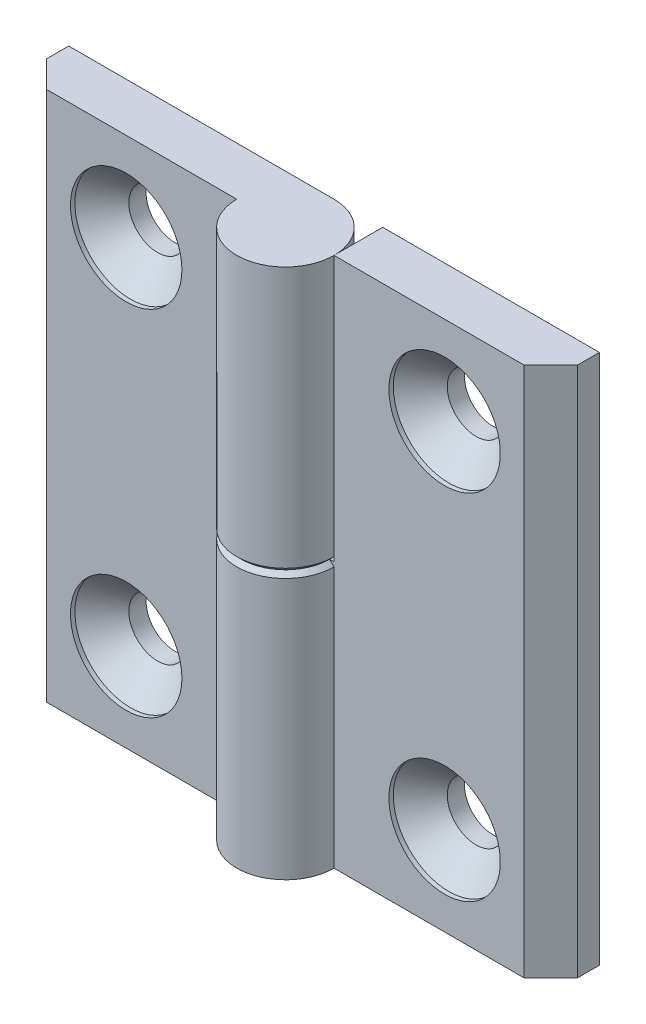
ISO-10303-21;
HEADER;
FILE_DESCRIPTION(('STEP AP214'),'2;1');
FILE_NAME('part.step','',(''),(''),'','','');
FILE_SCHEMA(('AUTOMOTIVE_DESIGN { 1 0 10303 214 1 1 1 1 }'));
ENDSEC;
DATA;
#1=APPLICATION_CONTEXT('core data for automotive mechanical design processes');
#2=APPLICATION_PROTOCOL_DEFINITION('international standard','automotive_design',2000,#1);
#3=PRODUCT_CONTEXT('',#1,'mechanical');
#4=PRODUCT('Part','Part','',(#3));
#5=PRODUCT_RELATED_PRODUCT_CATEGORY('part','',(#4));
#6=PRODUCT_DEFINITION_FORMATION('','',#4);
#7=PRODUCT_DEFINITION_CONTEXT('part definition',#1,'design');
#8=PRODUCT_DEFINITION('design','',#6,#7);
#9=PRODUCT_DEFINITION_SHAPE('','',#8);
#10=(LENGTH_UNIT() NAMED_UNIT(*) SI_UNIT(.MILLI.,.METRE.));
#11=(NAMED_UNIT(*) PLANE_ANGLE_UNIT() SI_UNIT($,.RADIAN.));
#12=(NAMED_UNIT(*) SI_UNIT($,.STERADIAN.) SOLID_ANGLE_UNIT());
#13=UNCERTAINTY_MEASURE_WITH_UNIT(LENGTH_MEASURE(1.E-05),#10,'distance_accuracy_value','');
#14=(GEOMETRIC_REPRESENTATION_CONTEXT(3) GLOBAL_UNCERTAINTY_ASSIGNED_CONTEXT((#13)) GLOBAL_UNIT_ASSIGNED_CONTEXT((#10,
#11,#12)) REPRESENTATION_CONTEXT('',''));
#15=CARTESIAN_POINT('',(0.,0.,0.));
#16=DIRECTION('',(0.,0.,1.));
#17=DIRECTION('',(1.,0.,0.));
#18=AXIS2_PLACEMENT_3D('',#15,#16,#17);
#19=CARTESIAN_POINT('',(0.,-30.,0.));
#20=DIRECTION('',(0.,1.,0.));
#21=DIRECTION('',(0.,0.,-1.));
#22=AXIS2_PLACEMENT_3D('',#19,#20,#21);
#23=CYLINDRICAL_SURFACE('',#22,5.5);
#24=DIRECTION('',(0.,1.,0.));
#25=VECTOR('',#24,1.);
#26=CARTESIAN_POINT('',(5.5,-30.,0.));
#27=LINE('',#26,#25);
#28=CARTESIAN_POINT('',(5.5,-30.,0.));
#29=VERTEX_POINT('',#28);
#30=CARTESIAN_POINT('',(5.5,-0.49999999999999,0.));
#31=VERTEX_POINT('',#30);
#32=EDGE_CURVE('E157',#29,#31,#27,.T.);
#33=ORIENTED_EDGE('',*,*,#32,.T.);
#34=CARTESIAN_POINT('',(0.,-0.49999999999999,0.));
#35=DIRECTION('',(0.,-1.,0.));
#36=DIRECTION('',(0.,0.,1.));
#37=AXIS2_PLACEMENT_3D('',#34,#35,#36);
#38=CIRCLE('',#37,5.5);
#39=CARTESIAN_POINT('',(0.,-0.49999999999999,-5.5));
#40=VERTEX_POINT('',#39);
#41=EDGE_CURVE('E175',#31,#40,#38,.T.);
#42=ORIENTED_EDGE('',*,*,#41,.T.);
#43=DIRECTION('',(0.,1.,0.));
#44=VECTOR('',#43,1.);
#45=CARTESIAN_POINT('',(0.,-30.,-5.5));
#46=LINE('',#45,#44);
#47=CARTESIAN_POINT('',(0.,-30.,-5.5));
#48=VERTEX_POINT('',#47);
#49=EDGE_CURVE('E167',#48,#40,#46,.T.);
#50=ORIENTED_EDGE('',*,*,#49,.F.);
#51=CARTESIAN_POINT('',(0.,-30.,0.));
#52=DIRECTION('',(0.,-1.,0.));
#53=DIRECTION('',(0.,0.,1.));
#54=AXIS2_PLACEMENT_3D('',#51,#52,#53);
#55=CIRCLE('',#54,5.5);
#56=EDGE_CURVE('E156',#29,#48,#55,.T.);
#57=ORIENTED_EDGE('',*,*,#56,.F.);
#58=EDGE_LOOP('',(#33,#42,#50,#57));
#59=FACE_BOUND('',#58,.T.);
#60=ADVANCED_FACE('F46',(#59),#23,.T.);
#61=CARTESIAN_POINT('',(0.,-30.,-5.5));
#62=DIRECTION('',(0.,0.,1.));
#63=DIRECTION('',(-1.,0.,0.));
#64=AXIS2_PLACEMENT_3D('',#61,#62,#63);
#65=PLANE('',#64);
#66=CARTESIAN_POINT('',(18.,-20.,-5.50000000000013));
#67=DIRECTION('',(0.,0.,1.));
#68=DIRECTION('',(-1.,0.,0.));
#69=AXIS2_PLACEMENT_3D('',#66,#67,#68);
#70=CIRCLE('',#69,3.25);
#71=CARTESIAN_POINT('',(14.75,-20.,-5.50000000000011));
#72=VERTEX_POINT('',#71);
#73=EDGE_CURVE('E197',#72,#72,#70,.T.);
#74=ORIENTED_EDGE('',*,*,#73,.T.);
#75=EDGE_LOOP('',(#74));
#76=FACE_BOUND('',#75,.T.);
#77=CARTESIAN_POINT('',(18.,20.,-5.50000000000013));
#78=DIRECTION('',(0.,0.,1.));
#79=DIRECTION('',(-1.,0.,0.));
#80=AXIS2_PLACEMENT_3D('',#77,#78,#79);
#81=CIRCLE('',#80,3.25);
#82=CARTESIAN_POINT('',(14.75,20.,-5.50000000000011));
#83=VERTEX_POINT('',#82);
#84=EDGE_CURVE('E139',#83,#83,#81,.T.);
#85=ORIENTED_EDGE('',*,*,#84,.T.);
#86=EDGE_LOOP('',(#85));
#87=FACE_BOUND('',#86,.T.);
#88=ORIENTED_EDGE('',*,*,#49,.T.);
#89=DIRECTION('',(1.,0.,0.));
#90=VECTOR('',#89,1.);
#91=CARTESIAN_POINT('',(0.,-0.49999999999999,-5.5));
#92=LINE('',#91,#90);
#93=CARTESIAN_POINT('',(5.49999999999996,-0.49999999999999,-5.50000000000004));
#94=VERTEX_POINT('',#93);
#95=EDGE_CURVE('E138',#40,#94,#92,.T.);
#96=ORIENTED_EDGE('',*,*,#95,.T.);
#97=DIRECTION('',(0.,1.,0.));
#98=VECTOR('',#97,1.);
#99=CARTESIAN_POINT('',(5.49999999999996,30.,-5.50000000000004));
#100=LINE('',#99,#98);
#101=CARTESIAN_POINT('',(5.49999999999996,30.,-5.50000000000004));
#102=VERTEX_POINT('',#101);
#103=EDGE_CURVE('E119',#94,#102,#100,.T.);
#104=ORIENTED_EDGE('',*,*,#103,.T.);
#105=DIRECTION('',(1.,0.,0.));
#106=VECTOR('',#105,1.);
#107=CARTESIAN_POINT('',(0.,30.,-5.5));
#108=LINE('',#107,#106);
#109=CARTESIAN_POINT('',(30.,30.,-5.50000000000022));
#110=VERTEX_POINT('',#109);
#111=EDGE_CURVE('E135',#102,#110,#108,.T.);
#112=ORIENTED_EDGE('',*,*,#111,.T.);
#113=DIRECTION('',(0.,1.,0.));
#114=VECTOR('',#113,1.);
#115=CARTESIAN_POINT('',(30.,-30.,-5.50000000000022));
#116=LINE('',#115,#114);
#117=CARTESIAN_POINT('',(30.,-30.,-5.50000000000022));
#118=VERTEX_POINT('',#117);
#119=EDGE_CURVE('E165',#118,#110,#116,.T.);
#120=ORIENTED_EDGE('',*,*,#119,.F.);
#121=DIRECTION('',(1.,0.,0.));
#122=VECTOR('',#121,1.);
#123=CARTESIAN_POINT('',(0.,-30.,-5.5));
#124=LINE('',#123,#122);
#125=EDGE_CURVE('E213',#48,#118,#124,.T.);
#126=ORIENTED_EDGE('',*,*,#125,.F.);
#127=EDGE_LOOP('',(#88,#96,#104,#112,#120,#126));
#128=FACE_BOUND('',#127,.T.);
#129=ADVANCED_FACE('F133',(#76,#87,#128),#65,.F.);
#130=CARTESIAN_POINT('',(30.,-30.,-5.50000000000022));
#131=DIRECTION('',(-1.,0.,0.));
#132=DIRECTION('',(0.,0.,-1.));
#133=AXIS2_PLACEMENT_3D('',#130,#131,#132);
#134=PLANE('',#133);
#135=DIRECTION('',(0.,0.,1.));
#136=VECTOR('',#135,1.);
#137=CARTESIAN_POINT('',(30.,30.,-5.50000000000022));
#138=LINE('',#137,#136);
#139=CARTESIAN_POINT('',(30.,30.,-3.00000000000022));
#140=VERTEX_POINT('',#139);
#141=EDGE_CURVE('E144',#110,#140,#138,.T.);
#142=ORIENTED_EDGE('',*,*,#141,.T.);
#143=DIRECTION('',(0.,1.,0.));
#144=VECTOR('',#143,1.);
#145=CARTESIAN_POINT('',(30.,-30.,-3.00000000000022));
#146=LINE('',#145,#144);
#147=CARTESIAN_POINT('',(30.,-30.,-3.00000000000022));
#148=VERTEX_POINT('',#147);
#149=EDGE_CURVE('E162',#148,#140,#146,.T.);
#150=ORIENTED_EDGE('',*,*,#149,.F.);
#151=DIRECTION('',(0.,0.,1.));
#152=VECTOR('',#151,1.);
#153=CARTESIAN_POINT('',(30.,-30.,-5.50000000000022));
#154=LINE('',#153,#152);
#155=EDGE_CURVE('E215',#118,#148,#154,.T.);
#156=ORIENTED_EDGE('',*,*,#155,.F.);
#157=ORIENTED_EDGE('',*,*,#119,.T.);
#158=EDGE_LOOP('',(#142,#150,#156,#157));
#159=FACE_BOUND('',#158,.T.);
#160=ADVANCED_FACE('F229',(#159),#134,.F.);
#161=CARTESIAN_POINT('',(30.,-30.,-3.00000000000022));
#162=DIRECTION('',(-0.707106781186549,0.,-0.707106781186546));
#163=DIRECTION('',(0.707106781186546,0.,-0.707106781186549));
#164=AXIS2_PLACEMENT_3D('',#161,#162,#163);
#165=PLANE('',#164);
#166=DIRECTION('',(-0.707106781186546,0.,0.707106781186549));
#167=VECTOR('',#166,1.);
#168=CARTESIAN_POINT('',(30.,30.,-3.00000000000022));
#169=LINE('',#168,#167);
#170=CARTESIAN_POINT('',(27.,30.,-2.01852808336478E-13));
#171=VERTEX_POINT('',#170);
#172=EDGE_CURVE('E146',#140,#171,#169,.T.);
#173=ORIENTED_EDGE('',*,*,#172,.T.);
#174=DIRECTION('',(0.,1.,0.));
#175=VECTOR('',#174,1.);
#176=CARTESIAN_POINT('',(27.,-30.,-2.01852808336478E-13));
#177=LINE('',#176,#175);
#178=CARTESIAN_POINT('',(27.,-30.,-2.01852808336478E-13));
#179=VERTEX_POINT('',#178);
#180=EDGE_CURVE('E159',#179,#171,#177,.T.);
#181=ORIENTED_EDGE('',*,*,#180,.F.);
#182=DIRECTION('',(-0.707106781186546,0.,0.707106781186549));
#183=VECTOR('',#182,1.);
#184=CARTESIAN_POINT('',(30.,-30.,-3.00000000000022));
#185=LINE('',#184,#183);
#186=EDGE_CURVE('E216',#148,#179,#185,.T.);
#187=ORIENTED_EDGE('',*,*,#186,.F.);
#188=ORIENTED_EDGE('',*,*,#149,.T.);
#189=EDGE_LOOP('',(#173,#181,#187,#188));
#190=FACE_BOUND('',#189,.T.);
#191=ADVANCED_FACE('F231',(#190),#165,.F.);
#192=CARTESIAN_POINT('',(27.,-30.,-2.01852808336478E-13));
#193=DIRECTION('',(0.,0.,-1.));
#194=DIRECTION('',(1.,0.,0.));
#195=AXIS2_PLACEMENT_3D('',#192,#193,#194);
#196=PLANE('',#195);
#197=CARTESIAN_POINT('',(18.,-20.,-1.34727625586711E-13));
#198=DIRECTION('',(0.,0.,1.));
#199=DIRECTION('',(-1.,0.,0.));
#200=AXIS2_PLACEMENT_3D('',#197,#198,#199);
#201=CIRCLE('',#200,6.3);
#202=CARTESIAN_POINT('',(11.7,-20.,0.));
#203=VERTEX_POINT('',#202);
#204=EDGE_CURVE('E185',#203,#203,#201,.T.);
#205=ORIENTED_EDGE('',*,*,#204,.F.);
#206=EDGE_LOOP('',(#205));
#207=FACE_BOUND('',#206,.T.);
#208=CARTESIAN_POINT('',(18.,20.,-1.34727625586711E-13));
#209=DIRECTION('',(0.,0.,1.));
#210=DIRECTION('',(-1.,0.,0.));
#211=AXIS2_PLACEMENT_3D('',#208,#209,#210);
#212=CIRCLE('',#211,6.3);
#213=CARTESIAN_POINT('',(11.7,20.,0.));
#214=VERTEX_POINT('',#213);
#215=EDGE_CURVE('E200',#214,#214,#212,.T.);
#216=ORIENTED_EDGE('',*,*,#215,.F.);
#217=EDGE_LOOP('',(#216));
#218=FACE_BOUND('',#217,.T.);
#219=DIRECTION('',(-1.,0.,0.));
#220=VECTOR('',#219,1.);
#221=CARTESIAN_POINT('',(27.,30.,-2.01852808336478E-13));
#222=LINE('',#221,#220);
#223=CARTESIAN_POINT('',(5.5,30.,0.));
#224=VERTEX_POINT('',#223);
#225=EDGE_CURVE('E154',#171,#224,#222,.T.);
#226=ORIENTED_EDGE('',*,*,#225,.T.);
#227=DIRECTION('',(0.,-1.,0.));
#228=VECTOR('',#227,1.);
#229=CARTESIAN_POINT('',(5.5,-30.,0.));
#230=LINE('',#229,#228);
#231=CARTESIAN_POINT('',(5.5,0.,0.));
#232=VERTEX_POINT('',#231);
#233=EDGE_CURVE('E123',#224,#232,#230,.T.);
#234=ORIENTED_EDGE('',*,*,#233,.T.);
#235=DIRECTION('',(1.,0.,0.));
#236=VECTOR('',#235,1.);
#237=CARTESIAN_POINT('',(-5.5,0.,0.));
#238=LINE('',#237,#236);
#239=CARTESIAN_POINT('',(5.00000000000001,0.,0.));
#240=VERTEX_POINT('',#239);
#241=EDGE_CURVE('E170',#240,#232,#238,.T.);
#242=ORIENTED_EDGE('',*,*,#241,.F.);
#243=DIRECTION('',(0.707106781186546,-0.707106781186549,0.));
#244=VECTOR('',#243,1.);
#245=CARTESIAN_POINT('',(0.,5.00000000000004,0.));
#246=LINE('',#245,#244);
#247=EDGE_CURVE('E12',#240,#31,#246,.T.);
#248=ORIENTED_EDGE('',*,*,#247,.T.);
#249=ORIENTED_EDGE('',*,*,#32,.F.);
#250=DIRECTION('',(-1.,0.,0.));
#251=VECTOR('',#250,1.);
#252=CARTESIAN_POINT('',(27.,-30.,-2.01852808336478E-13));
#253=LINE('',#252,#251);
#254=EDGE_CURVE('E150',#179,#29,#253,.T.);
#255=ORIENTED_EDGE('',*,*,#254,.F.);
#256=ORIENTED_EDGE('',*,*,#180,.T.);
#257=EDGE_LOOP('',(#226,#234,#242,#248,#249,#255,#256));
#258=FACE_BOUND('',#257,.T.);
#259=ADVANCED_FACE('F224',(#207,#218,#258),#196,.F.);
#260=CARTESIAN_POINT('',(0.,-30.,0.));
#261=DIRECTION('',(0.,-1.,0.));
#262=DIRECTION('',(0.,0.,1.));
#263=AXIS2_PLACEMENT_3D('',#260,#261,#262);
#264=PLANE('',#263);
#265=ORIENTED_EDGE('',*,*,#56,.T.);
#266=ORIENTED_EDGE('',*,*,#125,.T.);
#267=ORIENTED_EDGE('',*,*,#155,.T.);
#268=ORIENTED_EDGE('',*,*,#186,.T.);
#269=ORIENTED_EDGE('',*,*,#254,.T.);
#270=EDGE_LOOP('',(#265,#266,#267,#268,#269));
#271=FACE_BOUND('',#270,.T.);
#272=ADVANCED_FACE('F221',(#271),#264,.T.);
#273=CARTESIAN_POINT('',(0.,30.,0.));
#274=DIRECTION('',(0.,-1.,0.));
#275=DIRECTION('',(0.,0.,1.));
#276=AXIS2_PLACEMENT_3D('',#273,#274,#275);
#277=PLANE('',#276);
#278=ORIENTED_EDGE('',*,*,#111,.F.);
#279=DIRECTION('',(0.,0.,1.));
#280=VECTOR('',#279,1.);
#281=CARTESIAN_POINT('',(5.49999999999996,30.,-5.50000000000004));
#282=LINE('',#281,#280);
#283=EDGE_CURVE('E116',#102,#224,#282,.T.);
#284=ORIENTED_EDGE('',*,*,#283,.T.);
#285=ORIENTED_EDGE('',*,*,#225,.F.);
#286=ORIENTED_EDGE('',*,*,#172,.F.);
#287=ORIENTED_EDGE('',*,*,#141,.F.);
#288=EDGE_LOOP('',(#278,#284,#285,#286,#287));
#289=FACE_BOUND('',#288,.T.);
#290=ADVANCED_FACE('F142',(#289),#277,.F.);
#291=CARTESIAN_POINT('',(-5.50000000000004,0.,-5.49999999999996));
#292=DIRECTION('',(0.,-1.,0.));
#293=DIRECTION('',(0.,0.,1.));
#294=AXIS2_PLACEMENT_3D('',#291,#292,#293);
#295=PLANE('',#294);
#296=DIRECTION('',(0.,0.,1.));
#297=VECTOR('',#296,1.);
#298=CARTESIAN_POINT('',(5.49999999999996,0.,-5.50000000000004));
#299=LINE('',#298,#297);
#300=CARTESIAN_POINT('',(5.49999999999996,0.,-5.00000000000005));
#301=VERTEX_POINT('',#300);
#302=EDGE_CURVE('E128',#301,#232,#299,.T.);
#303=ORIENTED_EDGE('',*,*,#302,.F.);
#304=DIRECTION('',(-1.,0.,0.));
#305=VECTOR('',#304,1.);
#306=CARTESIAN_POINT('',(-5.50000000000004,0.,-4.99999999999997));
#307=LINE('',#306,#305);
#308=CARTESIAN_POINT('',(0.,0.,-5.00000000000001));
#309=VERTEX_POINT('',#308);
#310=EDGE_CURVE('E69',#301,#309,#307,.T.);
#311=ORIENTED_EDGE('',*,*,#310,.T.);
#312=CARTESIAN_POINT('',(0.,0.,0.));
#313=DIRECTION('',(0.,-1.,0.));
#314=DIRECTION('',(0.,0.,1.));
#315=AXIS2_PLACEMENT_3D('',#312,#313,#314);
#316=CIRCLE('',#315,5.00000000000001);
#317=EDGE_CURVE('E172',#309,#240,#316,.F.);
#318=ORIENTED_EDGE('',*,*,#317,.T.);
#319=ORIENTED_EDGE('',*,*,#241,.T.);
#320=EDGE_LOOP('',(#303,#311,#318,#319));
#321=FACE_BOUND('',#320,.T.);
#322=ADVANCED_FACE('F178',(#321),#295,.F.);
#323=CARTESIAN_POINT('',(5.49999999999996,30.,-5.50000000000004));
#324=DIRECTION('',(1.,0.,0.));
#325=DIRECTION('',(0.,0.,1.));
#326=AXIS2_PLACEMENT_3D('',#323,#324,#325);
#327=PLANE('',#326);
#328=ORIENTED_EDGE('',*,*,#283,.F.);
#329=ORIENTED_EDGE('',*,*,#103,.F.);
#330=DIRECTION('',(0.,-0.70710678118655,-0.707106781186546));
#331=VECTOR('',#330,1.);
#332=CARTESIAN_POINT('',(5.50000000000007,14.7500000000001,9.74999999999996));
#333=LINE('',#332,#331);
#334=EDGE_CURVE('E56',#94,#301,#333,.F.);
#335=ORIENTED_EDGE('',*,*,#334,.T.);
#336=ORIENTED_EDGE('',*,*,#302,.T.);
#337=ORIENTED_EDGE('',*,*,#233,.F.);
#338=EDGE_LOOP('',(#328,#329,#335,#336,#337));
#339=FACE_BOUND('',#338,.T.);
#340=ADVANCED_FACE('F118',(#339),#327,.F.);
#341=CARTESIAN_POINT('',(18.,20.,-1.34510785152214E-13));
#342=DIRECTION('',(0.,0.,1.));
#343=DIRECTION('',(-1.,0.,0.));
#344=AXIS2_PLACEMENT_3D('',#341,#342,#343);
#345=CYLINDRICAL_SURFACE('',#344,3.25);
#346=ORIENTED_EDGE('',*,*,#84,.F.);
#347=EDGE_LOOP('',(#346));
#348=FACE_BOUND('',#347,.T.);
#349=CARTESIAN_POINT('',(18.,20.,-3.55000000000013));
#350=DIRECTION('',(0.,0.,1.));
#351=DIRECTION('',(-1.,0.,0.));
#352=AXIS2_PLACEMENT_3D('',#349,#350,#351);
#353=CIRCLE('',#352,3.25);
#354=CARTESIAN_POINT('',(14.75,20.,-3.55000000000011));
#355=VERTEX_POINT('',#354);
#356=EDGE_CURVE('E206',#355,#355,#353,.T.);
#357=ORIENTED_EDGE('',*,*,#356,.T.);
#358=EDGE_LOOP('',(#357));
#359=FACE_BOUND('',#358,.T.);
#360=ADVANCED_FACE('F269',(#348,#359),#345,.F.);
#361=CARTESIAN_POINT('',(18.,20.,-0.500000000000135));
#362=DIRECTION('',(0.,0.,1.));
#363=DIRECTION('',(-1.,0.,0.));
#364=AXIS2_PLACEMENT_3D('',#361,#362,#363);
#365=CONICAL_SURFACE('',#364,6.3,0.785398163397449);
#366=ORIENTED_EDGE('',*,*,#356,.F.);
#367=EDGE_LOOP('',(#366));
#368=FACE_BOUND('',#367,.T.);
#369=CARTESIAN_POINT('',(18.,20.,-0.500000000000135));
#370=DIRECTION('',(0.,0.,1.));
#371=DIRECTION('',(-1.,0.,0.));
#372=AXIS2_PLACEMENT_3D('',#369,#370,#371);
#373=CIRCLE('',#372,6.3);
#374=CARTESIAN_POINT('',(11.7,20.,-0.500000000000088));
#375=VERTEX_POINT('',#374);
#376=EDGE_CURVE('E203',#375,#375,#373,.T.);
#377=ORIENTED_EDGE('',*,*,#376,.T.);
#378=EDGE_LOOP('',(#377));
#379=FACE_BOUND('',#378,.T.);
#380=ADVANCED_FACE('F272',(#368,#379),#365,.F.);
#381=CARTESIAN_POINT('',(18.,20.,-1.34510785152214E-13));
#382=DIRECTION('',(0.,0.,1.));
#383=DIRECTION('',(-1.,0.,0.));
#384=AXIS2_PLACEMENT_3D('',#381,#382,#383);
#385=CYLINDRICAL_SURFACE('',#384,6.3);
#386=ORIENTED_EDGE('',*,*,#376,.F.);
#387=EDGE_LOOP('',(#386));
#388=FACE_BOUND('',#387,.T.);
#389=ORIENTED_EDGE('',*,*,#215,.T.);
#390=EDGE_LOOP('',(#389));
#391=FACE_BOUND('',#390,.T.);
#392=ADVANCED_FACE('F276',(#388,#391),#385,.F.);
#393=CARTESIAN_POINT('',(18.,-20.,-1.34510785152214E-13));
#394=DIRECTION('',(0.,0.,1.));
#395=DIRECTION('',(-1.,0.,0.));
#396=AXIS2_PLACEMENT_3D('',#393,#394,#395);
#397=CYLINDRICAL_SURFACE('',#396,3.25);
#398=ORIENTED_EDGE('',*,*,#73,.F.);
#399=EDGE_LOOP('',(#398));
#400=FACE_BOUND('',#399,.T.);
#401=CARTESIAN_POINT('',(18.,-20.,-3.55000000000013));
#402=DIRECTION('',(0.,0.,1.));
#403=DIRECTION('',(-1.,0.,0.));
#404=AXIS2_PLACEMENT_3D('',#401,#402,#403);
#405=CIRCLE('',#404,3.25);
#406=CARTESIAN_POINT('',(14.75,-20.,-3.55000000000011));
#407=VERTEX_POINT('',#406);
#408=EDGE_CURVE('E192',#407,#407,#405,.T.);
#409=ORIENTED_EDGE('',*,*,#408,.T.);
#410=EDGE_LOOP('',(#409));
#411=FACE_BOUND('',#410,.T.);
#412=ADVANCED_FACE('F280',(#400,#411),#397,.F.);
#413=CARTESIAN_POINT('',(18.,-20.,-0.500000000000135));
#414=DIRECTION('',(0.,0.,1.));
#415=DIRECTION('',(-1.,0.,0.));
#416=AXIS2_PLACEMENT_3D('',#413,#414,#415);
#417=CONICAL_SURFACE('',#416,6.3,0.785398163397449);
#418=ORIENTED_EDGE('',*,*,#408,.F.);
#419=EDGE_LOOP('',(#418));
#420=FACE_BOUND('',#419,.T.);
#421=CARTESIAN_POINT('',(18.,-20.,-0.500000000000135));
#422=DIRECTION('',(0.,0.,1.));
#423=DIRECTION('',(-1.,0.,0.));
#424=AXIS2_PLACEMENT_3D('',#421,#422,#423);
#425=CIRCLE('',#424,6.3);
#426=CARTESIAN_POINT('',(11.7,-20.,-0.500000000000088));
#427=VERTEX_POINT('',#426);
#428=EDGE_CURVE('E187',#427,#427,#425,.T.);
#429=ORIENTED_EDGE('',*,*,#428,.T.);
#430=EDGE_LOOP('',(#429));
#431=FACE_BOUND('',#430,.T.);
#432=ADVANCED_FACE('F238',(#420,#431),#417,.F.);
#433=CARTESIAN_POINT('',(18.,-20.,-1.34510785152214E-13));
#434=DIRECTION('',(0.,0.,1.));
#435=DIRECTION('',(-1.,0.,0.));
#436=AXIS2_PLACEMENT_3D('',#433,#434,#435);
#437=CYLINDRICAL_SURFACE('',#436,6.3);
#438=ORIENTED_EDGE('',*,*,#428,.F.);
#439=EDGE_LOOP('',(#438));
#440=FACE_BOUND('',#439,.T.);
#441=ORIENTED_EDGE('',*,*,#204,.T.);
#442=EDGE_LOOP('',(#441));
#443=FACE_BOUND('',#442,.T.);
#444=ADVANCED_FACE('F233',(#440,#443),#437,.F.);
#445=CARTESIAN_POINT('',(0.,-0.49999999999999,0.));
#446=DIRECTION('',(0.,-1.,0.));
#447=DIRECTION('',(0.,0.,1.));
#448=AXIS2_PLACEMENT_3D('',#445,#446,#447);
#449=CONICAL_SURFACE('',#448,5.5,0.785398163397446);
#450=ORIENTED_EDGE('',*,*,#247,.F.);
#451=ORIENTED_EDGE('',*,*,#317,.F.);
#452=DIRECTION('',(0.,0.707106781186549,0.707106781186546));
#453=VECTOR('',#452,1.);
#454=CARTESIAN_POINT('',(0.,-0.49999999999999,-5.5));
#455=LINE('',#454,#453);
#456=EDGE_CURVE('E51',#40,#309,#455,.T.);
#457=ORIENTED_EDGE('',*,*,#456,.F.);
#458=ORIENTED_EDGE('',*,*,#41,.F.);
#459=EDGE_LOOP('',(#450,#451,#457,#458));
#460=FACE_BOUND('',#459,.T.);
#461=ADVANCED_FACE('F49',(#460),#449,.T.);
#462=CARTESIAN_POINT('',(0.,-0.49999999999999,-5.5));
#463=DIRECTION('',(0.,-0.707106781186546,0.70710678118655));
#464=DIRECTION('',(1.,0.,0.));
#465=AXIS2_PLACEMENT_3D('',#462,#463,#464);
#466=PLANE('',#465);
#467=ORIENTED_EDGE('',*,*,#456,.T.);
#468=ORIENTED_EDGE('',*,*,#310,.F.);
#469=ORIENTED_EDGE('',*,*,#334,.F.);
#470=ORIENTED_EDGE('',*,*,#95,.F.);
#471=EDGE_LOOP('',(#467,#468,#469,#470));
#472=FACE_BOUND('',#471,.T.);
#473=ADVANCED_FACE('F181',(#472),#466,.F.);
#474=CLOSED_SHELL('',(#60,#129,#160,#191,#259,#272,#290,#322,#340,#360,#380,#392,#412,#432,#444,
#461,#473));
#475=MANIFOLD_SOLID_BREP('B2',#474);
#476=CARTESIAN_POINT('',(0.,30.,0.));
#477=DIRECTION('',(0.,-1.,0.));
#478=DIRECTION('',(0.,0.,-1.));
#479=AXIS2_PLACEMENT_3D('',#476,#477,#478);
#480=CYLINDRICAL_SURFACE('',#479,5.5);
#481=DIRECTION('',(0.,-1.,0.));
#482=VECTOR('',#481,1.);
#483=CARTESIAN_POINT('',(-5.5,30.,0.));
#484=LINE('',#483,#482);
#485=CARTESIAN_POINT('',(-5.5,30.,0.));
#486=VERTEX_POINT('',#485);
#487=CARTESIAN_POINT('',(-5.5,0.49999999999999,0.));
#488=VERTEX_POINT('',#487);
#489=EDGE_CURVE('E512',#486,#488,#484,.T.);
#490=ORIENTED_EDGE('',*,*,#489,.T.);
#491=CARTESIAN_POINT('',(0.,0.49999999999999,0.));
#492=DIRECTION('',(0.,1.,0.));
#493=DIRECTION('',(0.,0.,1.));
#494=AXIS2_PLACEMENT_3D('',#491,#492,#493);
#495=CIRCLE('',#494,5.5);
#496=CARTESIAN_POINT('',(0.,0.49999999999999,-5.5));
#497=VERTEX_POINT('',#496);
#498=EDGE_CURVE('E530',#488,#497,#495,.T.);
#499=ORIENTED_EDGE('',*,*,#498,.T.);
#500=DIRECTION('',(0.,-1.,0.));
#501=VECTOR('',#500,1.);
#502=CARTESIAN_POINT('',(0.,30.,-5.5));
#503=LINE('',#502,#501);
#504=CARTESIAN_POINT('',(0.,30.,-5.5));
#505=VERTEX_POINT('',#504);
#506=EDGE_CURVE('E522',#505,#497,#503,.T.);
#507=ORIENTED_EDGE('',*,*,#506,.F.);
#508=CARTESIAN_POINT('',(0.,30.,0.));
#509=DIRECTION('',(0.,1.,0.));
#510=DIRECTION('',(0.,0.,1.));
#511=AXIS2_PLACEMENT_3D('',#508,#509,#510);
#512=CIRCLE('',#511,5.5);
#513=EDGE_CURVE('E511',#486,#505,#512,.T.);
#514=ORIENTED_EDGE('',*,*,#513,.F.);
#515=EDGE_LOOP('',(#490,#499,#507,#514));
#516=FACE_BOUND('',#515,.T.);
#517=ADVANCED_FACE('F401',(#516),#480,.T.);
#518=CARTESIAN_POINT('',(0.,30.,-5.5));
#519=DIRECTION('',(0.,0.,1.));
#520=DIRECTION('',(1.,0.,0.));
#521=AXIS2_PLACEMENT_3D('',#518,#519,#520);
#522=PLANE('',#521);
#523=CARTESIAN_POINT('',(-18.,20.,-5.5));
#524=DIRECTION('',(0.,0.,1.));
#525=DIRECTION('',(1.,0.,0.));
#526=AXIS2_PLACEMENT_3D('',#523,#524,#525);
#527=CIRCLE('',#526,3.25);
#528=CARTESIAN_POINT('',(-14.75,20.,-5.5));
#529=VERTEX_POINT('',#528);
#530=EDGE_CURVE('E552',#529,#529,#527,.T.);
#531=ORIENTED_EDGE('',*,*,#530,.T.);
#532=EDGE_LOOP('',(#531));
#533=FACE_BOUND('',#532,.T.);
#534=CARTESIAN_POINT('',(-18.,-20.,-5.5));
#535=DIRECTION('',(0.,0.,1.));
#536=DIRECTION('',(1.,0.,0.));
#537=AXIS2_PLACEMENT_3D('',#534,#535,#536);
#538=CIRCLE('',#537,3.25);
#539=CARTESIAN_POINT('',(-14.75,-20.,-5.5));
#540=VERTEX_POINT('',#539);
#541=EDGE_CURVE('E494',#540,#540,#538,.T.);
#542=ORIENTED_EDGE('',*,*,#541,.T.);
#543=EDGE_LOOP('',(#542));
#544=FACE_BOUND('',#543,.T.);
#545=ORIENTED_EDGE('',*,*,#506,.T.);
#546=DIRECTION('',(-1.,0.,0.));
#547=VECTOR('',#546,1.);
#548=CARTESIAN_POINT('',(0.,0.49999999999999,-5.5));
#549=LINE('',#548,#547);
#550=CARTESIAN_POINT('',(-5.5,0.49999999999999,-5.5));
#551=VERTEX_POINT('',#550);
#552=EDGE_CURVE('E493',#497,#551,#549,.T.);
#553=ORIENTED_EDGE('',*,*,#552,.T.);
#554=DIRECTION('',(0.,-1.,0.));
#555=VECTOR('',#554,1.);
#556=CARTESIAN_POINT('',(-5.5,-30.,-5.5));
#557=LINE('',#556,#555);
#558=CARTESIAN_POINT('',(-5.5,-30.,-5.5));
#559=VERTEX_POINT('',#558);
#560=EDGE_CURVE('E474',#551,#559,#557,.T.);
#561=ORIENTED_EDGE('',*,*,#560,.T.);
#562=DIRECTION('',(-1.,0.,0.));
#563=VECTOR('',#562,1.);
#564=CARTESIAN_POINT('',(0.,-30.,-5.5));
#565=LINE('',#564,#563);
#566=CARTESIAN_POINT('',(-30.,-30.,-5.5));
#567=VERTEX_POINT('',#566);
#568=EDGE_CURVE('E490',#559,#567,#565,.T.);
#569=ORIENTED_EDGE('',*,*,#568,.T.);
#570=DIRECTION('',(0.,-1.,0.));
#571=VECTOR('',#570,1.);
#572=CARTESIAN_POINT('',(-30.,30.,-5.5));
#573=LINE('',#572,#571);
#574=CARTESIAN_POINT('',(-30.,30.,-5.5));
#575=VERTEX_POINT('',#574);
#576=EDGE_CURVE('E520',#575,#567,#573,.T.);
#577=ORIENTED_EDGE('',*,*,#576,.F.);
#578=DIRECTION('',(-1.,0.,0.));
#579=VECTOR('',#578,1.);
#580=CARTESIAN_POINT('',(0.,30.,-5.5));
#581=LINE('',#580,#579);
#582=EDGE_CURVE('E568',#505,#575,#581,.T.);
#583=ORIENTED_EDGE('',*,*,#582,.F.);
#584=EDGE_LOOP('',(#545,#553,#561,#569,#577,#583));
#585=FACE_BOUND('',#584,.T.);
#586=ADVANCED_FACE('F488',(#533,#544,#585),#522,.F.);
#587=CARTESIAN_POINT('',(-30.,30.,-5.5));
#588=DIRECTION('',(1.,0.,0.));
#589=DIRECTION('',(0.,0.,-1.));
#590=AXIS2_PLACEMENT_3D('',#587,#588,#589);
#591=PLANE('',#590);
#592=DIRECTION('',(0.,0.,1.));
#593=VECTOR('',#592,1.);
#594=CARTESIAN_POINT('',(-30.,-30.,-5.5));
#595=LINE('',#594,#593);
#596=CARTESIAN_POINT('',(-30.,-30.,-3.));
#597=VERTEX_POINT('',#596);
#598=EDGE_CURVE('E499',#567,#597,#595,.T.);
#599=ORIENTED_EDGE('',*,*,#598,.T.);
#600=DIRECTION('',(0.,-1.,0.));
#601=VECTOR('',#600,1.);
#602=CARTESIAN_POINT('',(-30.,30.,-3.));
#603=LINE('',#602,#601);
#604=CARTESIAN_POINT('',(-30.,30.,-3.));
#605=VERTEX_POINT('',#604);
#606=EDGE_CURVE('E517',#605,#597,#603,.T.);
#607=ORIENTED_EDGE('',*,*,#606,.F.);
#608=DIRECTION('',(0.,0.,1.));
#609=VECTOR('',#608,1.);
#610=CARTESIAN_POINT('',(-30.,30.,-5.5));
#611=LINE('',#610,#609);
#612=EDGE_CURVE('E570',#575,#605,#611,.T.);
#613=ORIENTED_EDGE('',*,*,#612,.F.);
#614=ORIENTED_EDGE('',*,*,#576,.T.);
#615=EDGE_LOOP('',(#599,#607,#613,#614));
#616=FACE_BOUND('',#615,.T.);
#617=ADVANCED_FACE('F584',(#616),#591,.F.);
#618=CARTESIAN_POINT('',(-30.,30.,-3.));
#619=DIRECTION('',(0.707106781186543,0.,-0.707106781186552));
#620=DIRECTION('',(-0.707106781186552,0.,-0.707106781186543));
#621=AXIS2_PLACEMENT_3D('',#618,#619,#620);
#622=PLANE('',#621);
#623=DIRECTION('',(0.707106781186552,0.,0.707106781186543));
#624=VECTOR('',#623,1.);
#625=CARTESIAN_POINT('',(-30.,-30.,-3.));
#626=LINE('',#625,#624);
#627=CARTESIAN_POINT('',(-27.,-30.,0.));
#628=VERTEX_POINT('',#627);
#629=EDGE_CURVE('E501',#597,#628,#626,.T.);
#630=ORIENTED_EDGE('',*,*,#629,.T.);
#631=DIRECTION('',(0.,-1.,0.));
#632=VECTOR('',#631,1.);
#633=CARTESIAN_POINT('',(-27.,30.,0.));
#634=LINE('',#633,#632);
#635=CARTESIAN_POINT('',(-27.,30.,0.));
#636=VERTEX_POINT('',#635);
#637=EDGE_CURVE('E514',#636,#628,#634,.T.);
#638=ORIENTED_EDGE('',*,*,#637,.F.);
#639=DIRECTION('',(0.707106781186552,0.,0.707106781186543));
#640=VECTOR('',#639,1.);
#641=CARTESIAN_POINT('',(-30.,30.,-3.));
#642=LINE('',#641,#640);
#643=EDGE_CURVE('E571',#605,#636,#642,.T.);
#644=ORIENTED_EDGE('',*,*,#643,.F.);
#645=ORIENTED_EDGE('',*,*,#606,.T.);
#646=EDGE_LOOP('',(#630,#638,#644,#645));
#647=FACE_BOUND('',#646,.T.);
#648=ADVANCED_FACE('F586',(#647),#622,.F.);
#649=CARTESIAN_POINT('',(-27.,30.,0.));
#650=DIRECTION('',(0.,0.,-1.));
#651=DIRECTION('',(-1.,0.,0.));
#652=AXIS2_PLACEMENT_3D('',#649,#650,#651);
#653=PLANE('',#652);
#654=CARTESIAN_POINT('',(-18.,20.,0.));
#655=DIRECTION('',(0.,0.,1.));
#656=DIRECTION('',(1.,0.,0.));
#657=AXIS2_PLACEMENT_3D('',#654,#655,#656);
#658=CIRCLE('',#657,6.3);
#659=CARTESIAN_POINT('',(-11.7,20.,0.));
#660=VERTEX_POINT('',#659);
#661=EDGE_CURVE('E540',#660,#660,#658,.T.);
#662=ORIENTED_EDGE('',*,*,#661,.F.);
#663=EDGE_LOOP('',(#662));
#664=FACE_BOUND('',#663,.T.);
#665=CARTESIAN_POINT('',(-18.,-20.,0.));
#666=DIRECTION('',(0.,0.,1.));
#667=DIRECTION('',(1.,0.,0.));
#668=AXIS2_PLACEMENT_3D('',#665,#666,#667);
#669=CIRCLE('',#668,6.3);
#670=CARTESIAN_POINT('',(-11.7,-20.,0.));
#671=VERTEX_POINT('',#670);
#672=EDGE_CURVE('E555',#671,#671,#669,.T.);
#673=ORIENTED_EDGE('',*,*,#672,.F.);
#674=EDGE_LOOP('',(#673));
#675=FACE_BOUND('',#674,.T.);
#676=DIRECTION('',(1.,0.,0.));
#677=VECTOR('',#676,1.);
#678=CARTESIAN_POINT('',(-27.,-30.,0.));
#679=LINE('',#678,#677);
#680=CARTESIAN_POINT('',(-5.5,-30.,0.));
#681=VERTEX_POINT('',#680);
#682=EDGE_CURVE('E509',#628,#681,#679,.T.);
#683=ORIENTED_EDGE('',*,*,#682,.T.);
#684=DIRECTION('',(0.,1.,0.));
#685=VECTOR('',#684,1.);
#686=CARTESIAN_POINT('',(-5.5,30.,0.));
#687=LINE('',#686,#685);
#688=CARTESIAN_POINT('',(-5.5,0.,0.));
#689=VERTEX_POINT('',#688);
#690=EDGE_CURVE('E478',#681,#689,#687,.T.);
#691=ORIENTED_EDGE('',*,*,#690,.T.);
#692=DIRECTION('',(-1.,0.,0.));
#693=VECTOR('',#692,1.);
#694=CARTESIAN_POINT('',(5.5,0.,0.));
#695=LINE('',#694,#693);
#696=CARTESIAN_POINT('',(-5.00000000000001,0.,0.));
#697=VERTEX_POINT('',#696);
#698=EDGE_CURVE('E525',#697,#689,#695,.T.);
#699=ORIENTED_EDGE('',*,*,#698,.F.);
#700=DIRECTION('',(-0.707106781186546,0.707106781186549,0.));
#701=VECTOR('',#700,1.);
#702=CARTESIAN_POINT('',(0.,-5.00000000000004,0.));
#703=LINE('',#702,#701);
#704=EDGE_CURVE('E44',#697,#488,#703,.T.);
#705=ORIENTED_EDGE('',*,*,#704,.T.);
#706=ORIENTED_EDGE('',*,*,#489,.F.);
#707=DIRECTION('',(1.,0.,0.));
#708=VECTOR('',#707,1.);
#709=CARTESIAN_POINT('',(-27.,30.,0.));
#710=LINE('',#709,#708);
#711=EDGE_CURVE('E505',#636,#486,#710,.T.);
#712=ORIENTED_EDGE('',*,*,#711,.F.);
#713=ORIENTED_EDGE('',*,*,#637,.T.);
#714=EDGE_LOOP('',(#683,#691,#699,#705,#706,#712,#713));
#715=FACE_BOUND('',#714,.T.);
#716=ADVANCED_FACE('F579',(#664,#675,#715),#653,.F.);
#717=CARTESIAN_POINT('',(0.,30.,0.));
#718=DIRECTION('',(0.,1.,0.));
#719=DIRECTION('',(0.,0.,1.));
#720=AXIS2_PLACEMENT_3D('',#717,#718,#719);
#721=PLANE('',#720);
#722=ORIENTED_EDGE('',*,*,#513,.T.);
#723=ORIENTED_EDGE('',*,*,#582,.T.);
#724=ORIENTED_EDGE('',*,*,#612,.T.);
#725=ORIENTED_EDGE('',*,*,#643,.T.);
#726=ORIENTED_EDGE('',*,*,#711,.T.);
#727=EDGE_LOOP('',(#722,#723,#724,#725,#726));
#728=FACE_BOUND('',#727,.T.);
#729=ADVANCED_FACE('F576',(#728),#721,.T.);
#730=CARTESIAN_POINT('',(0.,-30.,0.));
#731=DIRECTION('',(0.,1.,0.));
#732=DIRECTION('',(0.,0.,1.));
#733=AXIS2_PLACEMENT_3D('',#730,#731,#732);
#734=PLANE('',#733);
#735=ORIENTED_EDGE('',*,*,#568,.F.);
#736=DIRECTION('',(0.,0.,1.));
#737=VECTOR('',#736,1.);
#738=CARTESIAN_POINT('',(-5.5,-30.,-5.5));
#739=LINE('',#738,#737);
#740=EDGE_CURVE('E471',#559,#681,#739,.T.);
#741=ORIENTED_EDGE('',*,*,#740,.T.);
#742=ORIENTED_EDGE('',*,*,#682,.F.);
#743=ORIENTED_EDGE('',*,*,#629,.F.);
#744=ORIENTED_EDGE('',*,*,#598,.F.);
#745=EDGE_LOOP('',(#735,#741,#742,#743,#744));
#746=FACE_BOUND('',#745,.T.);
#747=ADVANCED_FACE('F497',(#746),#734,.F.);
#748=CARTESIAN_POINT('',(5.5,0.,-5.5));
#749=DIRECTION('',(0.,1.,0.));
#750=DIRECTION('',(0.,0.,1.));
#751=AXIS2_PLACEMENT_3D('',#748,#749,#750);
#752=PLANE('',#751);
#753=DIRECTION('',(0.,0.,1.));
#754=VECTOR('',#753,1.);
#755=CARTESIAN_POINT('',(-5.5,0.,-5.5));
#756=LINE('',#755,#754);
#757=CARTESIAN_POINT('',(-5.5,0.,-5.00000000000001));
#758=VERTEX_POINT('',#757);
#759=EDGE_CURVE('E483',#758,#689,#756,.T.);
#760=ORIENTED_EDGE('',*,*,#759,.F.);
#761=DIRECTION('',(1.,0.,0.));
#762=VECTOR('',#761,1.);
#763=CARTESIAN_POINT('',(5.5,0.,-5.00000000000001));
#764=LINE('',#763,#762);
#765=CARTESIAN_POINT('',(0.,0.,-5.00000000000001));
#766=VERTEX_POINT('',#765);
#767=EDGE_CURVE('E424',#758,#766,#764,.T.);
#768=ORIENTED_EDGE('',*,*,#767,.T.);
#769=CARTESIAN_POINT('',(0.,0.,0.));
#770=DIRECTION('',(0.,1.,0.));
#771=DIRECTION('',(0.,0.,1.));
#772=AXIS2_PLACEMENT_3D('',#769,#770,#771);
#773=CIRCLE('',#772,5.00000000000001);
#774=EDGE_CURVE('E527',#766,#697,#773,.F.);
#775=ORIENTED_EDGE('',*,*,#774,.T.);
#776=ORIENTED_EDGE('',*,*,#698,.T.);
#777=EDGE_LOOP('',(#760,#768,#775,#776));
#778=FACE_BOUND('',#777,.T.);
#779=ADVANCED_FACE('F533',(#778),#752,.F.);
#780=CARTESIAN_POINT('',(-5.5,-30.,-5.5));
#781=DIRECTION('',(-1.,0.,0.));
#782=DIRECTION('',(0.,0.,1.));
#783=AXIS2_PLACEMENT_3D('',#780,#781,#782);
#784=PLANE('',#783);
#785=ORIENTED_EDGE('',*,*,#740,.F.);
#786=ORIENTED_EDGE('',*,*,#560,.F.);
#787=DIRECTION('',(0.,0.70710678118655,-0.707106781186546));
#788=VECTOR('',#787,1.);
#789=CARTESIAN_POINT('',(-5.5,-14.7500000000001,9.75));
#790=LINE('',#789,#788);
#791=EDGE_CURVE('E411',#551,#758,#790,.F.);
#792=ORIENTED_EDGE('',*,*,#791,.T.);
#793=ORIENTED_EDGE('',*,*,#759,.T.);
#794=ORIENTED_EDGE('',*,*,#690,.F.);
#795=EDGE_LOOP('',(#785,#786,#792,#793,#794));
#796=FACE_BOUND('',#795,.T.);
#797=ADVANCED_FACE('F473',(#796),#784,.F.);
#798=CARTESIAN_POINT('',(-18.,-20.,0.));
#799=DIRECTION('',(0.,0.,1.));
#800=DIRECTION('',(1.,0.,0.));
#801=AXIS2_PLACEMENT_3D('',#798,#799,#800);
#802=CYLINDRICAL_SURFACE('',#801,3.25);
#803=ORIENTED_EDGE('',*,*,#541,.F.);
#804=EDGE_LOOP('',(#803));
#805=FACE_BOUND('',#804,.T.);
#806=CARTESIAN_POINT('',(-18.,-20.,-3.55));
#807=DIRECTION('',(0.,0.,1.));
#808=DIRECTION('',(1.,0.,0.));
#809=AXIS2_PLACEMENT_3D('',#806,#807,#808);
#810=CIRCLE('',#809,3.25);
#811=CARTESIAN_POINT('',(-14.75,-20.,-3.55));
#812=VERTEX_POINT('',#811);
#813=EDGE_CURVE('E561',#812,#812,#810,.T.);
#814=ORIENTED_EDGE('',*,*,#813,.T.);
#815=EDGE_LOOP('',(#814));
#816=FACE_BOUND('',#815,.T.);
#817=ADVANCED_FACE('F624',(#805,#816),#802,.F.);
#818=CARTESIAN_POINT('',(-18.,-20.,-0.5));
#819=DIRECTION('',(0.,0.,1.));
#820=DIRECTION('',(1.,0.,0.));
#821=AXIS2_PLACEMENT_3D('',#818,#819,#820);
#822=CONICAL_SURFACE('',#821,6.3,0.785398163397449);
#823=ORIENTED_EDGE('',*,*,#813,.F.);
#824=EDGE_LOOP('',(#823));
#825=FACE_BOUND('',#824,.T.);
#826=CARTESIAN_POINT('',(-18.,-20.,-0.5));
#827=DIRECTION('',(0.,0.,1.));
#828=DIRECTION('',(1.,0.,0.));
#829=AXIS2_PLACEMENT_3D('',#826,#827,#828);
#830=CIRCLE('',#829,6.3);
#831=CARTESIAN_POINT('',(-11.7,-20.,-0.5));
#832=VERTEX_POINT('',#831);
#833=EDGE_CURVE('E558',#832,#832,#830,.T.);
#834=ORIENTED_EDGE('',*,*,#833,.T.);
#835=EDGE_LOOP('',(#834));
#836=FACE_BOUND('',#835,.T.);
#837=ADVANCED_FACE('F627',(#825,#836),#822,.F.);
#838=CARTESIAN_POINT('',(-18.,-20.,0.));
#839=DIRECTION('',(0.,0.,1.));
#840=DIRECTION('',(1.,0.,0.));
#841=AXIS2_PLACEMENT_3D('',#838,#839,#840);
#842=CYLINDRICAL_SURFACE('',#841,6.3);
#843=ORIENTED_EDGE('',*,*,#833,.F.);
#844=EDGE_LOOP('',(#843));
#845=FACE_BOUND('',#844,.T.);
#846=ORIENTED_EDGE('',*,*,#672,.T.);
#847=EDGE_LOOP('',(#846));
#848=FACE_BOUND('',#847,.T.);
#849=ADVANCED_FACE('F631',(#845,#848),#842,.F.);
#850=CARTESIAN_POINT('',(-18.,20.,0.));
#851=DIRECTION('',(0.,0.,1.));
#852=DIRECTION('',(1.,0.,0.));
#853=AXIS2_PLACEMENT_3D('',#850,#851,#852);
#854=CYLINDRICAL_SURFACE('',#853,3.25);
#855=ORIENTED_EDGE('',*,*,#530,.F.);
#856=EDGE_LOOP('',(#855));
#857=FACE_BOUND('',#856,.T.);
#858=CARTESIAN_POINT('',(-18.,20.,-3.55));
#859=DIRECTION('',(0.,0.,1.));
#860=DIRECTION('',(1.,0.,0.));
#861=AXIS2_PLACEMENT_3D('',#858,#859,#860);
#862=CIRCLE('',#861,3.25);
#863=CARTESIAN_POINT('',(-14.75,20.,-3.55));
#864=VERTEX_POINT('',#863);
#865=EDGE_CURVE('E547',#864,#864,#862,.T.);
#866=ORIENTED_EDGE('',*,*,#865,.T.);
#867=EDGE_LOOP('',(#866));
#868=FACE_BOUND('',#867,.T.);
#869=ADVANCED_FACE('F635',(#857,#868),#854,.F.);
#870=CARTESIAN_POINT('',(-18.,20.,-0.5));
#871=DIRECTION('',(0.,0.,1.));
#872=DIRECTION('',(1.,0.,0.));
#873=AXIS2_PLACEMENT_3D('',#870,#871,#872);
#874=CONICAL_SURFACE('',#873,6.3,0.785398163397449);
#875=ORIENTED_EDGE('',*,*,#865,.F.);
#876=EDGE_LOOP('',(#875));
#877=FACE_BOUND('',#876,.T.);
#878=CARTESIAN_POINT('',(-18.,20.,-0.5));
#879=DIRECTION('',(0.,0.,1.));
#880=DIRECTION('',(1.,0.,0.));
#881=AXIS2_PLACEMENT_3D('',#878,#879,#880);
#882=CIRCLE('',#881,6.3);
#883=CARTESIAN_POINT('',(-11.7,20.,-0.5));
#884=VERTEX_POINT('',#883);
#885=EDGE_CURVE('E542',#884,#884,#882,.T.);
#886=ORIENTED_EDGE('',*,*,#885,.T.);
#887=EDGE_LOOP('',(#886));
#888=FACE_BOUND('',#887,.T.);
#889=ADVANCED_FACE('F593',(#877,#888),#874,.F.);
#890=CARTESIAN_POINT('',(-18.,20.,0.));
#891=DIRECTION('',(0.,0.,1.));
#892=DIRECTION('',(1.,0.,0.));
#893=AXIS2_PLACEMENT_3D('',#890,#891,#892);
#894=CYLINDRICAL_SURFACE('',#893,6.3);
#895=ORIENTED_EDGE('',*,*,#885,.F.);
#896=EDGE_LOOP('',(#895));
#897=FACE_BOUND('',#896,.T.);
#898=ORIENTED_EDGE('',*,*,#661,.T.);
#899=EDGE_LOOP('',(#898));
#900=FACE_BOUND('',#899,.T.);
#901=ADVANCED_FACE('F588',(#897,#900),#894,.F.);
#902=CARTESIAN_POINT('',(0.,0.49999999999999,0.));
#903=DIRECTION('',(0.,1.,0.));
#904=DIRECTION('',(0.,0.,1.));
#905=AXIS2_PLACEMENT_3D('',#902,#903,#904);
#906=CONICAL_SURFACE('',#905,5.5,0.785398163397446);
#907=ORIENTED_EDGE('',*,*,#704,.F.);
#908=ORIENTED_EDGE('',*,*,#774,.F.);
#909=DIRECTION('',(0.,-0.707106781186549,0.707106781186546));
#910=VECTOR('',#909,1.);
#911=CARTESIAN_POINT('',(0.,0.49999999999999,-5.5));
#912=LINE('',#911,#910);
#913=EDGE_CURVE('E406',#497,#766,#912,.T.);
#914=ORIENTED_EDGE('',*,*,#913,.F.);
#915=ORIENTED_EDGE('',*,*,#498,.F.);
#916=EDGE_LOOP('',(#907,#908,#914,#915));
#917=FACE_BOUND('',#916,.T.);
#918=ADVANCED_FACE('F404',(#917),#906,.T.);
#919=CARTESIAN_POINT('',(0.,0.49999999999999,-5.5));
#920=DIRECTION('',(0.,0.707106781186546,0.70710678118655));
#921=DIRECTION('',(-1.,0.,0.));
#922=AXIS2_PLACEMENT_3D('',#919,#920,#921);
#923=PLANE('',#922);
#924=ORIENTED_EDGE('',*,*,#913,.T.);
#925=ORIENTED_EDGE('',*,*,#767,.F.);
#926=ORIENTED_EDGE('',*,*,#791,.F.);
#927=ORIENTED_EDGE('',*,*,#552,.F.);
#928=EDGE_LOOP('',(#924,#925,#926,#927));
#929=FACE_BOUND('',#928,.T.);
#930=ADVANCED_FACE('F536',(#929),#923,.F.);
#931=CLOSED_SHELL('',(#517,#586,#617,#648,#716,#729,#747,#779,#797,#817,#837,#849,#869,#889,
#901,#918,#930));
#932=MANIFOLD_SOLID_BREP('B6',#931);
#933=ADVANCED_BREP_SHAPE_REPRESENTATION('',(#18,#475,#932),#14);
#934=SHAPE_DEFINITION_REPRESENTATION(#9,#933);
ENDSEC;
END-ISO-10303-21;
